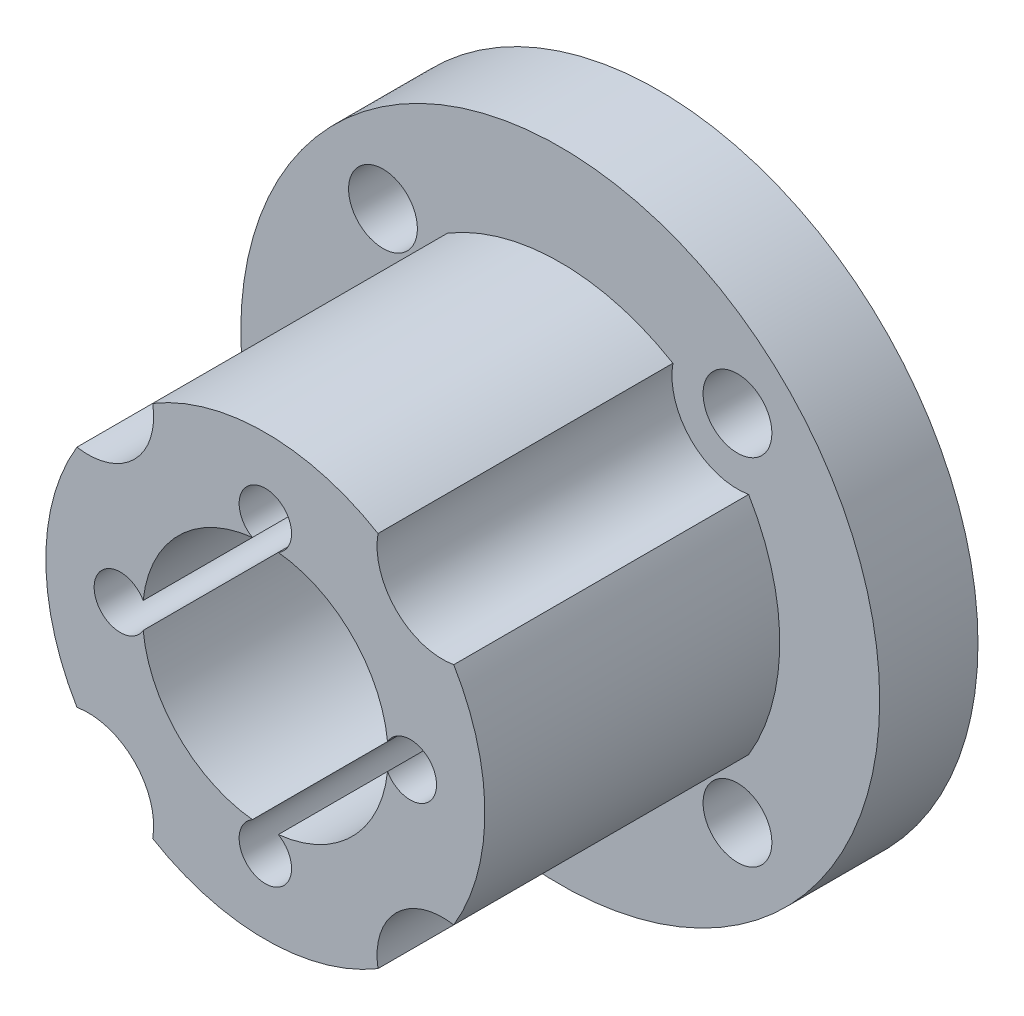
ISO-10303-21;
HEADER;
FILE_DESCRIPTION(('STEP AP214'),'2;1');
FILE_NAME('part.step','',(''),(''),'','','');
FILE_SCHEMA(('AUTOMOTIVE_DESIGN { 1 0 10303 214 1 1 1 1 }'));
ENDSEC;
DATA;
#1=APPLICATION_CONTEXT('core data for automotive mechanical design processes');
#2=APPLICATION_PROTOCOL_DEFINITION('international standard','automotive_design',2000,#1);
#3=PRODUCT_CONTEXT('',#1,'mechanical');
#4=PRODUCT('Part','Part','',(#3));
#5=PRODUCT_RELATED_PRODUCT_CATEGORY('part','',(#4));
#6=PRODUCT_DEFINITION_FORMATION('','',#4);
#7=PRODUCT_DEFINITION_CONTEXT('part definition',#1,'design');
#8=PRODUCT_DEFINITION('design','',#6,#7);
#9=PRODUCT_DEFINITION_SHAPE('','',#8);
#10=(LENGTH_UNIT() NAMED_UNIT(*) SI_UNIT(.MILLI.,.METRE.));
#11=(NAMED_UNIT(*) PLANE_ANGLE_UNIT() SI_UNIT($,.RADIAN.));
#12=(NAMED_UNIT(*) SI_UNIT($,.STERADIAN.) SOLID_ANGLE_UNIT());
#13=UNCERTAINTY_MEASURE_WITH_UNIT(LENGTH_MEASURE(1.E-05),#10,'distance_accuracy_value','');
#14=(GEOMETRIC_REPRESENTATION_CONTEXT(3) GLOBAL_UNCERTAINTY_ASSIGNED_CONTEXT((#13)) GLOBAL_UNIT_ASSIGNED_CONTEXT((#10,
#11,#12)) REPRESENTATION_CONTEXT('',''));
#15=CARTESIAN_POINT('',(0.,0.,0.));
#16=DIRECTION('',(0.,0.,1.));
#17=DIRECTION('',(1.,0.,0.));
#18=AXIS2_PLACEMENT_3D('',#15,#16,#17);
#19=CARTESIAN_POINT('',(-5.4093668760771,-5.40936687607708,-3.));
#20=DIRECTION('',(0.,0.,1.));
#21=DIRECTION('',(1.,0.,0.));
#22=AXIS2_PLACEMENT_3D('',#19,#20,#21);
#23=CYLINDRICAL_SURFACE('',#22,1.05);
#24=CARTESIAN_POINT('',(-5.4093668760771,-5.40936687607708,-3.));
#25=DIRECTION('',(0.,0.,1.));
#26=DIRECTION('',(1.,0.,0.));
#27=AXIS2_PLACEMENT_3D('',#24,#25,#26);
#28=CIRCLE('',#27,1.05);
#29=CARTESIAN_POINT('',(-4.3593668760771,-5.40936687607708,-3.));
#30=VERTEX_POINT('',#29);
#31=EDGE_CURVE('E393',#30,#30,#28,.T.);
#32=ORIENTED_EDGE('',*,*,#31,.F.);
#33=EDGE_LOOP('',(#32));
#34=FACE_BOUND('',#33,.T.);
#35=CARTESIAN_POINT('',(-5.4093668760771,-5.40936687607708,0.));
#36=DIRECTION('',(0.,0.,1.));
#37=DIRECTION('',(1.,0.,0.));
#38=AXIS2_PLACEMENT_3D('',#35,#36,#37);
#39=CIRCLE('',#38,1.05);
#40=CARTESIAN_POINT('',(-4.3593668760771,-5.40936687607708,0.));
#41=VERTEX_POINT('',#40);
#42=EDGE_CURVE('E396',#41,#41,#39,.T.);
#43=ORIENTED_EDGE('',*,*,#42,.T.);
#44=EDGE_LOOP('',(#43));
#45=FACE_BOUND('',#44,.T.);
#46=ADVANCED_FACE('F45',(#34,#45),#23,.F.);
#47=CARTESIAN_POINT('',(5.40936687607708,-5.4093668760771,-3.));
#48=DIRECTION('',(0.,0.,1.));
#49=DIRECTION('',(1.,0.,0.));
#50=AXIS2_PLACEMENT_3D('',#47,#48,#49);
#51=CYLINDRICAL_SURFACE('',#50,1.05);
#52=CARTESIAN_POINT('',(5.40936687607708,-5.4093668760771,-3.));
#53=DIRECTION('',(0.,0.,1.));
#54=DIRECTION('',(1.,0.,0.));
#55=AXIS2_PLACEMENT_3D('',#52,#53,#54);
#56=CIRCLE('',#55,1.05);
#57=CARTESIAN_POINT('',(6.45936687607708,-5.4093668760771,-3.));
#58=VERTEX_POINT('',#57);
#59=EDGE_CURVE('E399',#58,#58,#56,.T.);
#60=ORIENTED_EDGE('',*,*,#59,.F.);
#61=EDGE_LOOP('',(#60));
#62=FACE_BOUND('',#61,.T.);
#63=CARTESIAN_POINT('',(5.40936687607708,-5.4093668760771,0.));
#64=DIRECTION('',(0.,0.,1.));
#65=DIRECTION('',(1.,0.,0.));
#66=AXIS2_PLACEMENT_3D('',#63,#64,#65);
#67=CIRCLE('',#66,1.05);
#68=CARTESIAN_POINT('',(6.45936687607708,-5.4093668760771,0.));
#69=VERTEX_POINT('',#68);
#70=EDGE_CURVE('E402',#69,#69,#67,.T.);
#71=ORIENTED_EDGE('',*,*,#70,.T.);
#72=EDGE_LOOP('',(#71));
#73=FACE_BOUND('',#72,.T.);
#74=ADVANCED_FACE('F282',(#62,#73),#51,.F.);
#75=CARTESIAN_POINT('',(5.4093668760771,5.40936687607708,-3.));
#76=DIRECTION('',(0.,0.,1.));
#77=DIRECTION('',(1.,0.,0.));
#78=AXIS2_PLACEMENT_3D('',#75,#76,#77);
#79=CYLINDRICAL_SURFACE('',#78,1.05);
#80=CARTESIAN_POINT('',(5.4093668760771,5.40936687607708,-3.));
#81=DIRECTION('',(0.,0.,1.));
#82=DIRECTION('',(1.,0.,0.));
#83=AXIS2_PLACEMENT_3D('',#80,#81,#82);
#84=CIRCLE('',#83,1.05);
#85=CARTESIAN_POINT('',(6.4593668760771,5.40936687607708,-3.));
#86=VERTEX_POINT('',#85);
#87=EDGE_CURVE('E405',#86,#86,#84,.T.);
#88=ORIENTED_EDGE('',*,*,#87,.F.);
#89=EDGE_LOOP('',(#88));
#90=FACE_BOUND('',#89,.T.);
#91=CARTESIAN_POINT('',(5.4093668760771,5.40936687607708,0.));
#92=DIRECTION('',(0.,0.,1.));
#93=DIRECTION('',(1.,0.,0.));
#94=AXIS2_PLACEMENT_3D('',#91,#92,#93);
#95=CIRCLE('',#94,1.05);
#96=CARTESIAN_POINT('',(6.4593668760771,5.40936687607708,0.));
#97=VERTEX_POINT('',#96);
#98=EDGE_CURVE('E408',#97,#97,#95,.T.);
#99=ORIENTED_EDGE('',*,*,#98,.T.);
#100=EDGE_LOOP('',(#99));
#101=FACE_BOUND('',#100,.T.);
#102=ADVANCED_FACE('F288',(#90,#101),#79,.F.);
#103=CARTESIAN_POINT('',(-5.40936687607708,5.4093668760771,-3.));
#104=DIRECTION('',(0.,0.,1.));
#105=DIRECTION('',(1.,0.,0.));
#106=AXIS2_PLACEMENT_3D('',#103,#104,#105);
#107=CYLINDRICAL_SURFACE('',#106,1.05);
#108=CARTESIAN_POINT('',(-5.40936687607708,5.4093668760771,-3.));
#109=DIRECTION('',(0.,0.,1.));
#110=DIRECTION('',(1.,0.,0.));
#111=AXIS2_PLACEMENT_3D('',#108,#109,#110);
#112=CIRCLE('',#111,1.05);
#113=CARTESIAN_POINT('',(-4.35936687607708,5.4093668760771,-3.));
#114=VERTEX_POINT('',#113);
#115=EDGE_CURVE('E227',#114,#114,#112,.T.);
#116=ORIENTED_EDGE('',*,*,#115,.F.);
#117=EDGE_LOOP('',(#116));
#118=FACE_BOUND('',#117,.T.);
#119=CARTESIAN_POINT('',(-5.40936687607708,5.4093668760771,0.));
#120=DIRECTION('',(0.,0.,1.));
#121=DIRECTION('',(1.,0.,0.));
#122=AXIS2_PLACEMENT_3D('',#119,#120,#121);
#123=CIRCLE('',#122,1.05);
#124=CARTESIAN_POINT('',(-4.35936687607708,5.4093668760771,0.));
#125=VERTEX_POINT('',#124);
#126=EDGE_CURVE('E223',#125,#125,#123,.T.);
#127=ORIENTED_EDGE('',*,*,#126,.T.);
#128=EDGE_LOOP('',(#127));
#129=FACE_BOUND('',#128,.T.);
#130=ADVANCED_FACE('F299',(#118,#129),#107,.F.);
#131=CARTESIAN_POINT('',(0.,0.,9.));
#132=DIRECTION('',(0.,0.,-1.));
#133=DIRECTION('',(-1.,0.,0.));
#134=AXIS2_PLACEMENT_3D('',#131,#132,#133);
#135=CYLINDRICAL_SURFACE('',#134,6.7);
#136=CARTESIAN_POINT('',(0.,0.,0.));
#137=DIRECTION('',(0.,0.,1.));
#138=DIRECTION('',(1.,0.,0.));
#139=AXIS2_PLACEMENT_3D('',#136,#137,#138);
#140=CIRCLE('',#139,6.7);
#141=CARTESIAN_POINT('',(-5.75028464837844,3.43863729733498,0.));
#142=VERTEX_POINT('',#141);
#143=CARTESIAN_POINT('',(-5.75028464837845,-3.43863729733497,0.));
#144=VERTEX_POINT('',#143);
#145=EDGE_CURVE('E184',#142,#144,#140,.T.);
#146=ORIENTED_EDGE('',*,*,#145,.T.);
#147=DIRECTION('',(0.,0.,1.));
#148=VECTOR('',#147,1.);
#149=CARTESIAN_POINT('',(-5.75028464837845,-3.43863729733497,4.5));
#150=LINE('',#149,#148);
#151=CARTESIAN_POINT('',(-5.75028464837845,-3.43863729733497,9.));
#152=VERTEX_POINT('',#151);
#153=EDGE_CURVE('E164',#144,#152,#150,.T.);
#154=ORIENTED_EDGE('',*,*,#153,.T.);
#155=CARTESIAN_POINT('',(0.,0.,9.));
#156=DIRECTION('',(0.,0.,1.));
#157=DIRECTION('',(1.,0.,0.));
#158=AXIS2_PLACEMENT_3D('',#155,#156,#157);
#159=CIRCLE('',#158,6.7);
#160=CARTESIAN_POINT('',(-5.75028464837844,3.43863729733498,9.));
#161=VERTEX_POINT('',#160);
#162=EDGE_CURVE('E49',#161,#152,#159,.T.);
#163=ORIENTED_EDGE('',*,*,#162,.F.);
#164=DIRECTION('',(0.,0.,1.));
#165=VECTOR('',#164,1.);
#166=CARTESIAN_POINT('',(-5.75028464837844,3.43863729733498,4.5));
#167=LINE('',#166,#165);
#168=EDGE_CURVE('E390',#161,#142,#167,.F.);
#169=ORIENTED_EDGE('',*,*,#168,.T.);
#170=EDGE_LOOP('',(#146,#154,#163,#169));
#171=FACE_BOUND('',#170,.T.);
#172=ADVANCED_FACE('F303',(#171),#135,.T.);
#173=CARTESIAN_POINT('',(-3.43863729733498,-5.75028464837844,9.));
#174=VERTEX_POINT('',#173);
#175=CARTESIAN_POINT('',(3.43863729733496,-5.75028464837845,9.));
#176=VERTEX_POINT('',#175);
#177=EDGE_CURVE('E177',#174,#176,#159,.T.);
#178=ORIENTED_EDGE('',*,*,#177,.F.);
#179=DIRECTION('',(0.,0.,1.));
#180=VECTOR('',#179,1.);
#181=CARTESIAN_POINT('',(-3.43863729733498,-5.75028464837844,4.5));
#182=LINE('',#181,#180);
#183=CARTESIAN_POINT('',(-3.43863729733498,-5.75028464837844,0.));
#184=VERTEX_POINT('',#183);
#185=EDGE_CURVE('E161',#174,#184,#182,.F.);
#186=ORIENTED_EDGE('',*,*,#185,.T.);
#187=CARTESIAN_POINT('',(3.43863729733496,-5.75028464837845,0.));
#188=VERTEX_POINT('',#187);
#189=EDGE_CURVE('E175',#184,#188,#140,.T.);
#190=ORIENTED_EDGE('',*,*,#189,.T.);
#191=DIRECTION('',(0.,0.,1.));
#192=VECTOR('',#191,1.);
#193=CARTESIAN_POINT('',(3.43863729733496,-5.75028464837845,4.5));
#194=LINE('',#193,#192);
#195=EDGE_CURVE('E369',#188,#176,#194,.T.);
#196=ORIENTED_EDGE('',*,*,#195,.T.);
#197=EDGE_LOOP('',(#178,#186,#190,#196));
#198=FACE_BOUND('',#197,.T.);
#199=ADVANCED_FACE('F173',(#198),#135,.T.);
#200=CARTESIAN_POINT('',(5.75028464837844,-3.43863729733498,9.));
#201=VERTEX_POINT('',#200);
#202=CARTESIAN_POINT('',(5.75028464837845,3.43863729733497,9.));
#203=VERTEX_POINT('',#202);
#204=EDGE_CURVE('E200',#201,#203,#159,.T.);
#205=ORIENTED_EDGE('',*,*,#204,.F.);
#206=DIRECTION('',(0.,0.,1.));
#207=VECTOR('',#206,1.);
#208=CARTESIAN_POINT('',(5.75028464837844,-3.43863729733498,4.5));
#209=LINE('',#208,#207);
#210=CARTESIAN_POINT('',(5.75028464837844,-3.43863729733498,0.));
#211=VERTEX_POINT('',#210);
#212=EDGE_CURVE('E365',#201,#211,#209,.F.);
#213=ORIENTED_EDGE('',*,*,#212,.T.);
#214=CARTESIAN_POINT('',(5.75028464837845,3.43863729733497,0.));
#215=VERTEX_POINT('',#214);
#216=EDGE_CURVE('E185',#211,#215,#140,.T.);
#217=ORIENTED_EDGE('',*,*,#216,.T.);
#218=DIRECTION('',(0.,0.,1.));
#219=VECTOR('',#218,1.);
#220=CARTESIAN_POINT('',(5.75028464837845,3.43863729733497,4.5));
#221=LINE('',#220,#219);
#222=EDGE_CURVE('E379',#215,#203,#221,.T.);
#223=ORIENTED_EDGE('',*,*,#222,.T.);
#224=EDGE_LOOP('',(#205,#213,#217,#223));
#225=FACE_BOUND('',#224,.T.);
#226=ADVANCED_FACE('F340',(#225),#135,.T.);
#227=CARTESIAN_POINT('',(0.,0.,9.));
#228=DIRECTION('',(0.,0.,-1.));
#229=DIRECTION('',(-1.,0.,0.));
#230=AXIS2_PLACEMENT_3D('',#227,#228,#229);
#231=CYLINDRICAL_SURFACE('',#230,3.75);
#232=DIRECTION('',(0.,0.,1.));
#233=VECTOR('',#232,1.);
#234=CARTESIAN_POINT('',(3.72916666666667,-0.39473531919783,3.));
#235=LINE('',#234,#233);
#236=CARTESIAN_POINT('',(3.72916666666667,-0.394735319197838,-3.));
#237=VERTEX_POINT('',#236);
#238=CARTESIAN_POINT('',(3.72916666666667,-0.394735319197823,9.));
#239=VERTEX_POINT('',#238);
#240=EDGE_CURVE('E213',#237,#239,#235,.T.);
#241=ORIENTED_EDGE('',*,*,#240,.F.);
#242=CARTESIAN_POINT('',(0.,0.,-3.));
#243=DIRECTION('',(0.,0.,1.));
#244=DIRECTION('',(1.,0.,0.));
#245=AXIS2_PLACEMENT_3D('',#242,#243,#244);
#246=CIRCLE('',#245,3.75);
#247=CARTESIAN_POINT('',(0.394735319197838,-3.72916666666667,-3.));
#248=VERTEX_POINT('',#247);
#249=EDGE_CURVE('E329',#248,#237,#246,.T.);
#250=ORIENTED_EDGE('',*,*,#249,.F.);
#251=DIRECTION('',(0.,0.,1.));
#252=VECTOR('',#251,1.);
#253=CARTESIAN_POINT('',(0.39473531919783,-3.72916666666667,3.));
#254=LINE('',#253,#252);
#255=CARTESIAN_POINT('',(0.394735319197823,-3.72916666666667,9.));
#256=VERTEX_POINT('',#255);
#257=EDGE_CURVE('E69',#256,#248,#254,.F.);
#258=ORIENTED_EDGE('',*,*,#257,.F.);
#259=CARTESIAN_POINT('',(0.,0.,9.));
#260=DIRECTION('',(0.,0.,1.));
#261=DIRECTION('',(1.,0.,0.));
#262=AXIS2_PLACEMENT_3D('',#259,#260,#261);
#263=CIRCLE('',#262,3.75);
#264=EDGE_CURVE('E202',#256,#239,#263,.T.);
#265=ORIENTED_EDGE('',*,*,#264,.T.);
#266=EDGE_LOOP('',(#241,#250,#258,#265));
#267=FACE_BOUND('',#266,.T.);
#268=ADVANCED_FACE('F211',(#267),#231,.F.);
#269=DIRECTION('',(0.,0.,1.));
#270=VECTOR('',#269,1.);
#271=CARTESIAN_POINT('',(-0.394735319197828,-3.72916666666667,3.));
#272=LINE('',#271,#270);
#273=CARTESIAN_POINT('',(-0.394735319197836,-3.72916666666667,-3.));
#274=VERTEX_POINT('',#273);
#275=CARTESIAN_POINT('',(-0.394735319197821,-3.72916666666667,9.));
#276=VERTEX_POINT('',#275);
#277=EDGE_CURVE('E236',#274,#276,#272,.T.);
#278=ORIENTED_EDGE('',*,*,#277,.F.);
#279=CARTESIAN_POINT('',(-3.72916666666667,-0.394735319197838,-3.));
#280=VERTEX_POINT('',#279);
#281=EDGE_CURVE('E258',#280,#274,#246,.T.);
#282=ORIENTED_EDGE('',*,*,#281,.F.);
#283=DIRECTION('',(0.,0.,1.));
#284=VECTOR('',#283,1.);
#285=CARTESIAN_POINT('',(-3.72916666666667,-0.39473531919783,3.));
#286=LINE('',#285,#284);
#287=CARTESIAN_POINT('',(-3.72916666666667,-0.394735319197823,9.));
#288=VERTEX_POINT('',#287);
#289=EDGE_CURVE('E243',#288,#280,#286,.F.);
#290=ORIENTED_EDGE('',*,*,#289,.F.);
#291=EDGE_CURVE('E195',#288,#276,#263,.T.);
#292=ORIENTED_EDGE('',*,*,#291,.T.);
#293=EDGE_LOOP('',(#278,#282,#290,#292));
#294=FACE_BOUND('',#293,.T.);
#295=ADVANCED_FACE('F326',(#294),#231,.F.);
#296=DIRECTION('',(0.,0.,1.));
#297=VECTOR('',#296,1.);
#298=CARTESIAN_POINT('',(-3.72916666666667,0.394735319197828,3.));
#299=LINE('',#298,#297);
#300=CARTESIAN_POINT('',(-3.72916666666667,0.394735319197836,-3.));
#301=VERTEX_POINT('',#300);
#302=CARTESIAN_POINT('',(-3.72916666666667,0.394735319197821,9.));
#303=VERTEX_POINT('',#302);
#304=EDGE_CURVE('E245',#301,#303,#299,.T.);
#305=ORIENTED_EDGE('',*,*,#304,.F.);
#306=CARTESIAN_POINT('',(-0.394735319197836,3.72916666666667,-3.));
#307=VERTEX_POINT('',#306);
#308=EDGE_CURVE('E256',#307,#301,#246,.T.);
#309=ORIENTED_EDGE('',*,*,#308,.F.);
#310=DIRECTION('',(0.,0.,1.));
#311=VECTOR('',#310,1.);
#312=CARTESIAN_POINT('',(-0.394735319197828,3.72916666666667,3.));
#313=LINE('',#312,#311);
#314=CARTESIAN_POINT('',(-0.394735319197826,3.72916666666667,9.));
#315=VERTEX_POINT('',#314);
#316=EDGE_CURVE('E249',#315,#307,#313,.F.);
#317=ORIENTED_EDGE('',*,*,#316,.F.);
#318=EDGE_CURVE('E192',#315,#303,#263,.T.);
#319=ORIENTED_EDGE('',*,*,#318,.T.);
#320=EDGE_LOOP('',(#305,#309,#317,#319));
#321=FACE_BOUND('',#320,.T.);
#322=ADVANCED_FACE('F334',(#321),#231,.F.);
#323=DIRECTION('',(0.,0.,1.));
#324=VECTOR('',#323,1.);
#325=CARTESIAN_POINT('',(3.72916666666667,0.394735319197828,3.));
#326=LINE('',#325,#324);
#327=CARTESIAN_POINT('',(3.72916666666667,0.394735319197821,9.));
#328=VERTEX_POINT('',#327);
#329=CARTESIAN_POINT('',(3.72916666666667,0.394735319197836,-3.));
#330=VERTEX_POINT('',#329);
#331=EDGE_CURVE('E62',#328,#330,#326,.F.);
#332=ORIENTED_EDGE('',*,*,#331,.F.);
#333=CARTESIAN_POINT('',(0.394735319197823,3.72916666666667,9.));
#334=VERTEX_POINT('',#333);
#335=EDGE_CURVE('E187',#328,#334,#263,.T.);
#336=ORIENTED_EDGE('',*,*,#335,.T.);
#337=DIRECTION('',(0.,0.,1.));
#338=VECTOR('',#337,1.);
#339=CARTESIAN_POINT('',(0.39473531919783,3.72916666666667,3.));
#340=LINE('',#339,#338);
#341=CARTESIAN_POINT('',(0.394735319197838,3.72916666666667,-3.));
#342=VERTEX_POINT('',#341);
#343=EDGE_CURVE('E253',#342,#334,#340,.T.);
#344=ORIENTED_EDGE('',*,*,#343,.F.);
#345=EDGE_CURVE('E255',#330,#342,#246,.T.);
#346=ORIENTED_EDGE('',*,*,#345,.F.);
#347=EDGE_LOOP('',(#332,#336,#344,#346));
#348=FACE_BOUND('',#347,.T.);
#349=ADVANCED_FACE('F47',(#348),#231,.F.);
#350=CARTESIAN_POINT('',(3.43863729733498,5.75028464837844,9.));
#351=VERTEX_POINT('',#350);
#352=CARTESIAN_POINT('',(-3.43863729733497,5.75028464837845,9.));
#353=VERTEX_POINT('',#352);
#354=EDGE_CURVE('E194',#351,#353,#159,.T.);
#355=ORIENTED_EDGE('',*,*,#354,.F.);
#356=DIRECTION('',(0.,0.,1.));
#357=VECTOR('',#356,1.);
#358=CARTESIAN_POINT('',(3.43863729733498,5.75028464837844,4.5));
#359=LINE('',#358,#357);
#360=CARTESIAN_POINT('',(3.43863729733498,5.75028464837844,0.));
#361=VERTEX_POINT('',#360);
#362=EDGE_CURVE('E374',#351,#361,#359,.F.);
#363=ORIENTED_EDGE('',*,*,#362,.T.);
#364=CARTESIAN_POINT('',(-3.43863729733497,5.75028464837845,0.));
#365=VERTEX_POINT('',#364);
#366=EDGE_CURVE('E188',#361,#365,#140,.T.);
#367=ORIENTED_EDGE('',*,*,#366,.T.);
#368=DIRECTION('',(0.,0.,1.));
#369=VECTOR('',#368,1.);
#370=CARTESIAN_POINT('',(-3.43863729733497,5.75028464837845,4.5));
#371=LINE('',#370,#369);
#372=EDGE_CURVE('E385',#365,#353,#371,.T.);
#373=ORIENTED_EDGE('',*,*,#372,.T.);
#374=EDGE_LOOP('',(#355,#363,#367,#373));
#375=FACE_BOUND('',#374,.T.);
#376=ADVANCED_FACE('F333',(#375),#135,.T.);
#377=CARTESIAN_POINT('',(0.,0.,9.));
#378=DIRECTION('',(0.,0.,1.));
#379=DIRECTION('',(1.,0.,0.));
#380=AXIS2_PLACEMENT_3D('',#377,#378,#379);
#381=PLANE('',#380);
#382=CARTESIAN_POINT('',(-5.4093668760771,-5.40936687607708,9.));
#383=DIRECTION('',(0.,0.,1.));
#384=DIRECTION('',(1.,0.,0.));
#385=AXIS2_PLACEMENT_3D('',#382,#383,#384);
#386=CIRCLE('',#385,2.);
#387=EDGE_CURVE('E169',#174,#152,#386,.T.);
#388=ORIENTED_EDGE('',*,*,#387,.F.);
#389=ORIENTED_EDGE('',*,*,#177,.T.);
#390=CARTESIAN_POINT('',(5.40936687607708,-5.4093668760771,9.));
#391=DIRECTION('',(0.,0.,1.));
#392=DIRECTION('',(1.,0.,0.));
#393=AXIS2_PLACEMENT_3D('',#390,#391,#392);
#394=CIRCLE('',#393,2.);
#395=EDGE_CURVE('E363',#201,#176,#394,.T.);
#396=ORIENTED_EDGE('',*,*,#395,.F.);
#397=ORIENTED_EDGE('',*,*,#204,.T.);
#398=CARTESIAN_POINT('',(5.4093668760771,5.40936687607708,9.));
#399=DIRECTION('',(0.,0.,1.));
#400=DIRECTION('',(1.,0.,0.));
#401=AXIS2_PLACEMENT_3D('',#398,#399,#400);
#402=CIRCLE('',#401,2.);
#403=EDGE_CURVE('E371',#351,#203,#402,.T.);
#404=ORIENTED_EDGE('',*,*,#403,.F.);
#405=ORIENTED_EDGE('',*,*,#354,.T.);
#406=CARTESIAN_POINT('',(-5.40936687607708,5.4093668760771,9.));
#407=DIRECTION('',(0.,0.,1.));
#408=DIRECTION('',(1.,0.,0.));
#409=AXIS2_PLACEMENT_3D('',#406,#407,#408);
#410=CIRCLE('',#409,2.);
#411=EDGE_CURVE('E382',#161,#353,#410,.T.);
#412=ORIENTED_EDGE('',*,*,#411,.F.);
#413=ORIENTED_EDGE('',*,*,#162,.T.);
#414=EDGE_LOOP('',(#388,#389,#396,#397,#404,#405,#412,#413));
#415=FACE_BOUND('',#414,.T.);
#416=CARTESIAN_POINT('',(4.425,0.,9.));
#417=DIRECTION('',(0.,0.,1.));
#418=DIRECTION('',(1.,0.,0.));
#419=AXIS2_PLACEMENT_3D('',#416,#417,#418);
#420=CIRCLE('',#419,0.799999999999988);
#421=EDGE_CURVE('E221',#239,#328,#420,.T.);
#422=ORIENTED_EDGE('',*,*,#421,.F.);
#423=ORIENTED_EDGE('',*,*,#264,.F.);
#424=CARTESIAN_POINT('',(0.,-4.425,9.));
#425=DIRECTION('',(0.,0.,1.));
#426=DIRECTION('',(1.,0.,0.));
#427=AXIS2_PLACEMENT_3D('',#424,#425,#426);
#428=CIRCLE('',#427,0.799999999999988);
#429=EDGE_CURVE('E220',#276,#256,#428,.T.);
#430=ORIENTED_EDGE('',*,*,#429,.F.);
#431=ORIENTED_EDGE('',*,*,#291,.F.);
#432=CARTESIAN_POINT('',(-4.425,0.,9.));
#433=DIRECTION('',(0.,0.,1.));
#434=DIRECTION('',(1.,0.,0.));
#435=AXIS2_PLACEMENT_3D('',#432,#433,#434);
#436=CIRCLE('',#435,0.799999999999988);
#437=EDGE_CURVE('E238',#303,#288,#436,.T.);
#438=ORIENTED_EDGE('',*,*,#437,.F.);
#439=ORIENTED_EDGE('',*,*,#318,.F.);
#440=CARTESIAN_POINT('',(0.,4.425,9.));
#441=DIRECTION('',(0.,0.,1.));
#442=DIRECTION('',(1.,0.,0.));
#443=AXIS2_PLACEMENT_3D('',#440,#441,#442);
#444=CIRCLE('',#443,0.799999999999988);
#445=EDGE_CURVE('E247',#334,#315,#444,.T.);
#446=ORIENTED_EDGE('',*,*,#445,.F.);
#447=ORIENTED_EDGE('',*,*,#335,.F.);
#448=EDGE_LOOP('',(#422,#423,#430,#431,#438,#439,#446,#447));
#449=FACE_BOUND('',#448,.T.);
#450=ADVANCED_FACE('F218',(#415,#449),#381,.T.);
#451=CARTESIAN_POINT('',(0.,0.,0.));
#452=DIRECTION('',(0.,0.,1.));
#453=DIRECTION('',(1.,0.,0.));
#454=AXIS2_PLACEMENT_3D('',#451,#452,#453);
#455=PLANE('',#454);
#456=ORIENTED_EDGE('',*,*,#42,.F.);
#457=EDGE_LOOP('',(#456));
#458=FACE_BOUND('',#457,.T.);
#459=ORIENTED_EDGE('',*,*,#189,.F.);
#460=CARTESIAN_POINT('',(-5.4093668760771,-5.40936687607708,0.));
#461=DIRECTION('',(0.,0.,1.));
#462=DIRECTION('',(1.,0.,0.));
#463=AXIS2_PLACEMENT_3D('',#460,#461,#462);
#464=CIRCLE('',#463,2.);
#465=EDGE_CURVE('E158',#144,#184,#464,.F.);
#466=ORIENTED_EDGE('',*,*,#465,.F.);
#467=ORIENTED_EDGE('',*,*,#145,.F.);
#468=CARTESIAN_POINT('',(-5.40936687607708,5.4093668760771,0.));
#469=DIRECTION('',(0.,0.,1.));
#470=DIRECTION('',(1.,0.,0.));
#471=AXIS2_PLACEMENT_3D('',#468,#469,#470);
#472=CIRCLE('',#471,2.);
#473=EDGE_CURVE('E383',#365,#142,#472,.F.);
#474=ORIENTED_EDGE('',*,*,#473,.F.);
#475=ORIENTED_EDGE('',*,*,#366,.F.);
#476=CARTESIAN_POINT('',(5.4093668760771,5.40936687607708,0.));
#477=DIRECTION('',(0.,0.,1.));
#478=DIRECTION('',(1.,0.,0.));
#479=AXIS2_PLACEMENT_3D('',#476,#477,#478);
#480=CIRCLE('',#479,2.);
#481=EDGE_CURVE('E372',#215,#361,#480,.F.);
#482=ORIENTED_EDGE('',*,*,#481,.F.);
#483=ORIENTED_EDGE('',*,*,#216,.F.);
#484=CARTESIAN_POINT('',(5.40936687607708,-5.4093668760771,0.));
#485=DIRECTION('',(0.,0.,1.));
#486=DIRECTION('',(1.,0.,0.));
#487=AXIS2_PLACEMENT_3D('',#484,#485,#486);
#488=CIRCLE('',#487,2.);
#489=EDGE_CURVE('E183',#188,#211,#488,.F.);
#490=ORIENTED_EDGE('',*,*,#489,.F.);
#491=EDGE_LOOP('',(#459,#466,#467,#474,#475,#482,#483,#490));
#492=FACE_BOUND('',#491,.T.);
#493=ORIENTED_EDGE('',*,*,#70,.F.);
#494=EDGE_LOOP('',(#493));
#495=FACE_BOUND('',#494,.T.);
#496=ORIENTED_EDGE('',*,*,#98,.F.);
#497=EDGE_LOOP('',(#496));
#498=FACE_BOUND('',#497,.T.);
#499=ORIENTED_EDGE('',*,*,#126,.F.);
#500=EDGE_LOOP('',(#499));
#501=FACE_BOUND('',#500,.T.);
#502=CARTESIAN_POINT('',(0.,0.,0.));
#503=DIRECTION('',(0.,0.,1.));
#504=DIRECTION('',(1.,0.,0.));
#505=AXIS2_PLACEMENT_3D('',#502,#503,#504);
#506=CIRCLE('',#505,9.75);
#507=CARTESIAN_POINT('',(9.75,0.,0.));
#508=VERTEX_POINT('',#507);
#509=EDGE_CURVE('E190',#508,#508,#506,.T.);
#510=ORIENTED_EDGE('',*,*,#509,.T.);
#511=EDGE_LOOP('',(#510));
#512=FACE_BOUND('',#511,.T.);
#513=ADVANCED_FACE('F180',(#458,#492,#495,#498,#501,#512),#455,.T.);
#514=CARTESIAN_POINT('',(0.,0.,-3.));
#515=DIRECTION('',(0.,0.,1.));
#516=DIRECTION('',(1.,0.,0.));
#517=AXIS2_PLACEMENT_3D('',#514,#515,#516);
#518=CYLINDRICAL_SURFACE('',#517,9.75);
#519=CARTESIAN_POINT('',(0.,0.,-3.));
#520=DIRECTION('',(0.,0.,1.));
#521=DIRECTION('',(1.,0.,0.));
#522=AXIS2_PLACEMENT_3D('',#519,#520,#521);
#523=CIRCLE('',#522,9.75);
#524=CARTESIAN_POINT('',(9.75,0.,-3.));
#525=VERTEX_POINT('',#524);
#526=EDGE_CURVE('E259',#525,#525,#523,.T.);
#527=ORIENTED_EDGE('',*,*,#526,.T.);
#528=EDGE_LOOP('',(#527));
#529=FACE_BOUND('',#528,.T.);
#530=ORIENTED_EDGE('',*,*,#509,.F.);
#531=EDGE_LOOP('',(#530));
#532=FACE_BOUND('',#531,.T.);
#533=ADVANCED_FACE('F267',(#529,#532),#518,.T.);
#534=CARTESIAN_POINT('',(0.,0.,-3.));
#535=DIRECTION('',(0.,0.,1.));
#536=DIRECTION('',(1.,0.,0.));
#537=AXIS2_PLACEMENT_3D('',#534,#535,#536);
#538=PLANE('',#537);
#539=ORIENTED_EDGE('',*,*,#31,.T.);
#540=EDGE_LOOP('',(#539));
#541=FACE_BOUND('',#540,.T.);
#542=ORIENTED_EDGE('',*,*,#59,.T.);
#543=EDGE_LOOP('',(#542));
#544=FACE_BOUND('',#543,.T.);
#545=ORIENTED_EDGE('',*,*,#87,.T.);
#546=EDGE_LOOP('',(#545));
#547=FACE_BOUND('',#546,.T.);
#548=ORIENTED_EDGE('',*,*,#115,.T.);
#549=EDGE_LOOP('',(#548));
#550=FACE_BOUND('',#549,.T.);
#551=ORIENTED_EDGE('',*,*,#249,.T.);
#552=CARTESIAN_POINT('',(4.425,0.,-3.));
#553=DIRECTION('',(0.,0.,1.));
#554=DIRECTION('',(1.,0.,0.));
#555=AXIS2_PLACEMENT_3D('',#552,#553,#554);
#556=CIRCLE('',#555,0.799999999999998);
#557=EDGE_CURVE('E12',#237,#330,#556,.T.);
#558=ORIENTED_EDGE('',*,*,#557,.T.);
#559=ORIENTED_EDGE('',*,*,#345,.T.);
#560=CARTESIAN_POINT('',(0.,4.425,-3.));
#561=DIRECTION('',(0.,0.,1.));
#562=DIRECTION('',(1.,0.,0.));
#563=AXIS2_PLACEMENT_3D('',#560,#561,#562);
#564=CIRCLE('',#563,0.799999999999998);
#565=EDGE_CURVE('E234',#342,#307,#564,.T.);
#566=ORIENTED_EDGE('',*,*,#565,.T.);
#567=ORIENTED_EDGE('',*,*,#308,.T.);
#568=CARTESIAN_POINT('',(-4.425,0.,-3.));
#569=DIRECTION('',(0.,0.,1.));
#570=DIRECTION('',(1.,0.,0.));
#571=AXIS2_PLACEMENT_3D('',#568,#569,#570);
#572=CIRCLE('',#571,0.799999999999998);
#573=EDGE_CURVE('E240',#301,#280,#572,.T.);
#574=ORIENTED_EDGE('',*,*,#573,.T.);
#575=ORIENTED_EDGE('',*,*,#281,.T.);
#576=CARTESIAN_POINT('',(0.,-4.425,-3.));
#577=DIRECTION('',(0.,0.,1.));
#578=DIRECTION('',(1.,0.,0.));
#579=AXIS2_PLACEMENT_3D('',#576,#577,#578);
#580=CIRCLE('',#579,0.799999999999998);
#581=EDGE_CURVE('E54',#274,#248,#580,.T.);
#582=ORIENTED_EDGE('',*,*,#581,.T.);
#583=EDGE_LOOP('',(#551,#558,#559,#566,#567,#574,#575,#582));
#584=FACE_BOUND('',#583,.T.);
#585=ORIENTED_EDGE('',*,*,#526,.F.);
#586=EDGE_LOOP('',(#585));
#587=FACE_BOUND('',#586,.T.);
#588=ADVANCED_FACE('F269',(#541,#544,#547,#550,#584,#587),#538,.F.);
#589=CARTESIAN_POINT('',(0.,4.425,9.));
#590=DIRECTION('',(0.,0.,1.));
#591=DIRECTION('',(1.,0.,0.));
#592=AXIS2_PLACEMENT_3D('',#589,#590,#591);
#593=CYLINDRICAL_SURFACE('',#592,0.799999999999993);
#594=ORIENTED_EDGE('',*,*,#343,.T.);
#595=ORIENTED_EDGE('',*,*,#445,.T.);
#596=ORIENTED_EDGE('',*,*,#316,.T.);
#597=ORIENTED_EDGE('',*,*,#565,.F.);
#598=EDGE_LOOP('',(#594,#595,#596,#597));
#599=FACE_BOUND('',#598,.T.);
#600=ADVANCED_FACE('F275',(#599),#593,.F.);
#601=CARTESIAN_POINT('',(-4.425,0.,9.));
#602=DIRECTION('',(0.,0.,1.));
#603=DIRECTION('',(1.,0.,0.));
#604=AXIS2_PLACEMENT_3D('',#601,#602,#603);
#605=CYLINDRICAL_SURFACE('',#604,0.799999999999993);
#606=ORIENTED_EDGE('',*,*,#304,.T.);
#607=ORIENTED_EDGE('',*,*,#437,.T.);
#608=ORIENTED_EDGE('',*,*,#289,.T.);
#609=ORIENTED_EDGE('',*,*,#573,.F.);
#610=EDGE_LOOP('',(#606,#607,#608,#609));
#611=FACE_BOUND('',#610,.T.);
#612=ADVANCED_FACE('F311',(#611),#605,.F.);
#613=CARTESIAN_POINT('',(0.,-4.425,9.));
#614=DIRECTION('',(0.,0.,1.));
#615=DIRECTION('',(1.,0.,0.));
#616=AXIS2_PLACEMENT_3D('',#613,#614,#615);
#617=CYLINDRICAL_SURFACE('',#616,0.799999999999993);
#618=ORIENTED_EDGE('',*,*,#277,.T.);
#619=ORIENTED_EDGE('',*,*,#429,.T.);
#620=ORIENTED_EDGE('',*,*,#257,.T.);
#621=ORIENTED_EDGE('',*,*,#581,.F.);
#622=EDGE_LOOP('',(#618,#619,#620,#621));
#623=FACE_BOUND('',#622,.T.);
#624=ADVANCED_FACE('F308',(#623),#617,.F.);
#625=CARTESIAN_POINT('',(4.425,0.,9.));
#626=DIRECTION('',(0.,0.,1.));
#627=DIRECTION('',(1.,0.,0.));
#628=AXIS2_PLACEMENT_3D('',#625,#626,#627);
#629=CYLINDRICAL_SURFACE('',#628,0.799999999999993);
#630=ORIENTED_EDGE('',*,*,#240,.T.);
#631=ORIENTED_EDGE('',*,*,#421,.T.);
#632=ORIENTED_EDGE('',*,*,#331,.T.);
#633=ORIENTED_EDGE('',*,*,#557,.F.);
#634=EDGE_LOOP('',(#630,#631,#632,#633));
#635=FACE_BOUND('',#634,.T.);
#636=ADVANCED_FACE('F305',(#635),#629,.F.);
#637=CARTESIAN_POINT('',(-5.40936687607708,5.4093668760771,-5.65685424949238));
#638=DIRECTION('',(0.,0.,1.));
#639=DIRECTION('',(1.,0.,0.));
#640=AXIS2_PLACEMENT_3D('',#637,#638,#639);
#641=CYLINDRICAL_SURFACE('',#640,2.);
#642=ORIENTED_EDGE('',*,*,#411,.T.);
#643=ORIENTED_EDGE('',*,*,#372,.F.);
#644=ORIENTED_EDGE('',*,*,#473,.T.);
#645=ORIENTED_EDGE('',*,*,#168,.F.);
#646=EDGE_LOOP('',(#642,#643,#644,#645));
#647=FACE_BOUND('',#646,.T.);
#648=ADVANCED_FACE('F294',(#647),#641,.F.);
#649=CARTESIAN_POINT('',(5.4093668760771,5.40936687607708,-5.65685424949238));
#650=DIRECTION('',(0.,0.,1.));
#651=DIRECTION('',(1.,0.,0.));
#652=AXIS2_PLACEMENT_3D('',#649,#650,#651);
#653=CYLINDRICAL_SURFACE('',#652,2.);
#654=ORIENTED_EDGE('',*,*,#481,.T.);
#655=ORIENTED_EDGE('',*,*,#362,.F.);
#656=ORIENTED_EDGE('',*,*,#403,.T.);
#657=ORIENTED_EDGE('',*,*,#222,.F.);
#658=EDGE_LOOP('',(#654,#655,#656,#657));
#659=FACE_BOUND('',#658,.T.);
#660=ADVANCED_FACE('F435',(#659),#653,.F.);
#661=CARTESIAN_POINT('',(5.40936687607708,-5.4093668760771,-5.65685424949238));
#662=DIRECTION('',(0.,0.,1.));
#663=DIRECTION('',(1.,0.,0.));
#664=AXIS2_PLACEMENT_3D('',#661,#662,#663);
#665=CYLINDRICAL_SURFACE('',#664,2.);
#666=ORIENTED_EDGE('',*,*,#489,.T.);
#667=ORIENTED_EDGE('',*,*,#212,.F.);
#668=ORIENTED_EDGE('',*,*,#395,.T.);
#669=ORIENTED_EDGE('',*,*,#195,.F.);
#670=EDGE_LOOP('',(#666,#667,#668,#669));
#671=FACE_BOUND('',#670,.T.);
#672=ADVANCED_FACE('F438',(#671),#665,.F.);
#673=CARTESIAN_POINT('',(-5.4093668760771,-5.40936687607708,-5.65685424949238));
#674=DIRECTION('',(0.,0.,1.));
#675=DIRECTION('',(1.,0.,0.));
#676=AXIS2_PLACEMENT_3D('',#673,#674,#675);
#677=CYLINDRICAL_SURFACE('',#676,2.);
#678=ORIENTED_EDGE('',*,*,#465,.T.);
#679=ORIENTED_EDGE('',*,*,#185,.F.);
#680=ORIENTED_EDGE('',*,*,#387,.T.);
#681=ORIENTED_EDGE('',*,*,#153,.F.);
#682=EDGE_LOOP('',(#678,#679,#680,#681));
#683=FACE_BOUND('',#682,.T.);
#684=ADVANCED_FACE('F160',(#683),#677,.F.);
#685=CLOSED_SHELL('',(#46,#74,#102,#130,#172,#199,#226,#268,#295,#322,#349,#376,#450,#513,#533,
#588,#600,#612,#624,#636,#648,#660,#672,#684));
#686=MANIFOLD_SOLID_BREP('B2',#685);
#687=ADVANCED_BREP_SHAPE_REPRESENTATION('',(#18,#686),#14);
#688=SHAPE_DEFINITION_REPRESENTATION(#9,#687);
ENDSEC;
END-ISO-10303-21;
